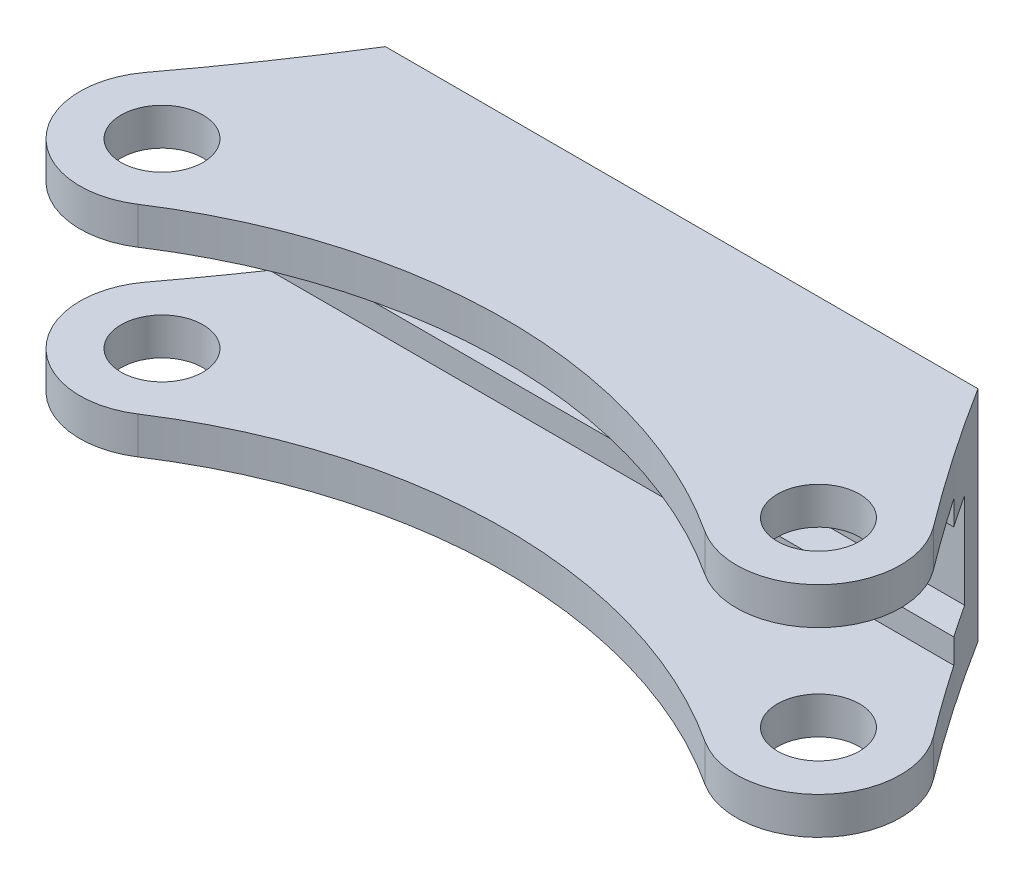
ISO-10303-21;
HEADER;
FILE_DESCRIPTION(('STEP AP214'),'2;1');
FILE_NAME('part.step','',(''),(''),'','','');
FILE_SCHEMA(('AUTOMOTIVE_DESIGN { 1 0 10303 214 1 1 1 1 }'));
ENDSEC;
DATA;
#1=APPLICATION_CONTEXT('core data for automotive mechanical design processes');
#2=APPLICATION_PROTOCOL_DEFINITION('international standard','automotive_design',2000,#1);
#3=PRODUCT_CONTEXT('',#1,'mechanical');
#4=PRODUCT('Part','Part','',(#3));
#5=PRODUCT_RELATED_PRODUCT_CATEGORY('part','',(#4));
#6=PRODUCT_DEFINITION_FORMATION('','',#4);
#7=PRODUCT_DEFINITION_CONTEXT('part definition',#1,'design');
#8=PRODUCT_DEFINITION('design','',#6,#7);
#9=PRODUCT_DEFINITION_SHAPE('','',#8);
#10=(LENGTH_UNIT() NAMED_UNIT(*) SI_UNIT(.MILLI.,.METRE.));
#11=(NAMED_UNIT(*) PLANE_ANGLE_UNIT() SI_UNIT($,.RADIAN.));
#12=(NAMED_UNIT(*) SI_UNIT($,.STERADIAN.) SOLID_ANGLE_UNIT());
#13=UNCERTAINTY_MEASURE_WITH_UNIT(LENGTH_MEASURE(1.E-05),#10,'distance_accuracy_value','');
#14=(GEOMETRIC_REPRESENTATION_CONTEXT(3) GLOBAL_UNCERTAINTY_ASSIGNED_CONTEXT((#13)) GLOBAL_UNIT_ASSIGNED_CONTEXT((#10,
#11,#12)) REPRESENTATION_CONTEXT('',''));
#15=CARTESIAN_POINT('',(0.,0.,0.));
#16=DIRECTION('',(0.,0.,1.));
#17=DIRECTION('',(1.,0.,0.));
#18=AXIS2_PLACEMENT_3D('',#15,#16,#17);
#19=CARTESIAN_POINT('',(47.625,-8.382,4.318));
#20=DIRECTION('',(0.,0.,-1.));
#21=DIRECTION('',(1.,0.,0.));
#22=AXIS2_PLACEMENT_3D('',#19,#20,#21);
#23=PLANE('',#22);
#24=CARTESIAN_POINT('',(19.05,0.,4.318));
#25=DIRECTION('',(0.,0.,-1.));
#26=DIRECTION('',(1.,0.,0.));
#27=AXIS2_PLACEMENT_3D('',#24,#25,#26);
#28=CIRCLE('',#27,3.175);
#29=CARTESIAN_POINT('',(22.225,0.,4.318));
#30=VERTEX_POINT('',#29);
#31=EDGE_CURVE('E272',#30,#30,#28,.T.);
#32=ORIENTED_EDGE('',*,*,#31,.T.);
#33=EDGE_LOOP('',(#32));
#34=FACE_BOUND('',#33,.T.);
#35=CARTESIAN_POINT('',(-19.05,0.,4.318));
#36=DIRECTION('',(0.,0.,-1.));
#37=DIRECTION('',(-1.,0.,0.));
#38=AXIS2_PLACEMENT_3D('',#35,#36,#37);
#39=CIRCLE('',#38,3.175);
#40=CARTESIAN_POINT('',(-22.225,0.,4.318));
#41=VERTEX_POINT('',#40);
#42=EDGE_CURVE('E276',#41,#41,#39,.T.);
#43=ORIENTED_EDGE('',*,*,#42,.T.);
#44=EDGE_LOOP('',(#43));
#45=FACE_BOUND('',#44,.T.);
#46=DIRECTION('',(-1.,0.,0.));
#47=VECTOR('',#46,1.);
#48=CARTESIAN_POINT('',(52.3875,5.5245,4.318));
#49=LINE('',#48,#47);
#50=CARTESIAN_POINT('',(37.1595016436992,5.5245,4.31799999999999));
#51=VERTEX_POINT('',#50);
#52=CARTESIAN_POINT('',(-37.1595016436991,5.5245,4.31799999999999));
#53=VERTEX_POINT('',#52);
#54=EDGE_CURVE('E263',#51,#53,#49,.T.);
#55=ORIENTED_EDGE('',*,*,#54,.T.);
#56=DIRECTION('',(0.,1.,0.));
#57=VECTOR('',#56,1.);
#58=CARTESIAN_POINT('',(-37.1595016436991,-12.7,4.31799999999999));
#59=LINE('',#58,#57);
#60=CARTESIAN_POINT('',(-37.1595016436992,-5.5245,4.31799999999993));
#61=VERTEX_POINT('',#60);
#62=EDGE_CURVE('E247',#61,#53,#59,.T.);
#63=ORIENTED_EDGE('',*,*,#62,.F.);
#64=DIRECTION('',(-1.,0.,0.));
#65=VECTOR('',#64,1.);
#66=CARTESIAN_POINT('',(52.3875,-5.5245,4.318));
#67=LINE('',#66,#65);
#68=CARTESIAN_POINT('',(37.1595016436992,-5.5245,4.31799999999993));
#69=VERTEX_POINT('',#68);
#70=EDGE_CURVE('E261',#69,#61,#67,.T.);
#71=ORIENTED_EDGE('',*,*,#70,.F.);
#72=DIRECTION('',(0.,1.,0.));
#73=VECTOR('',#72,1.);
#74=CARTESIAN_POINT('',(37.1595016436992,-12.7,4.31799999999999));
#75=LINE('',#74,#73);
#76=EDGE_CURVE('E223',#51,#69,#75,.F.);
#77=ORIENTED_EDGE('',*,*,#76,.F.);
#78=EDGE_LOOP('',(#55,#63,#71,#77));
#79=FACE_BOUND('',#78,.T.);
#80=ADVANCED_FACE('F34',(#34,#45,#79),#23,.F.);
#81=CARTESIAN_POINT('',(47.625,-8.382,4.318));
#82=DIRECTION('',(0.,-1.,0.));
#83=DIRECTION('',(0.,0.,1.));
#84=AXIS2_PLACEMENT_3D('',#81,#82,#83);
#85=PLANE('',#84);
#86=CARTESIAN_POINT('',(38.1,-8.382,22.225));
#87=DIRECTION('',(0.,1.,0.));
#88=DIRECTION('',(0.,0.,1.));
#89=AXIS2_PLACEMENT_3D('',#86,#87,#88);
#90=CIRCLE('',#89,4.7625);
#91=CARTESIAN_POINT('',(38.1,-8.382,26.9875));
#92=VERTEX_POINT('',#91);
#93=EDGE_CURVE('E300',#92,#92,#90,.T.);
#94=ORIENTED_EDGE('',*,*,#93,.F.);
#95=EDGE_LOOP('',(#94));
#96=FACE_BOUND('',#95,.T.);
#97=CARTESIAN_POINT('',(-38.1,-8.382,22.225));
#98=DIRECTION('',(0.,1.,0.));
#99=DIRECTION('',(0.,0.,1.));
#100=AXIS2_PLACEMENT_3D('',#97,#98,#99);
#101=CIRCLE('',#100,4.7625);
#102=CARTESIAN_POINT('',(-38.1,-8.382,26.9875));
#103=VERTEX_POINT('',#102);
#104=EDGE_CURVE('E290',#103,#103,#101,.T.);
#105=ORIENTED_EDGE('',*,*,#104,.F.);
#106=EDGE_LOOP('',(#105));
#107=FACE_BOUND('',#106,.T.);
#108=CARTESIAN_POINT('',(0.,-8.382,80.7691073038098));
#109=DIRECTION('',(0.,1.,0.));
#110=DIRECTION('',(0.,0.,1.));
#111=AXIS2_PLACEMENT_3D('',#108,#109,#110);
#112=CIRCLE('',#111,60.325);
#113=CARTESIAN_POINT('',(32.9045454545455,-8.382,30.2082873596104));
#114=VERTEX_POINT('',#113);
#115=CARTESIAN_POINT('',(-32.9045454545455,-8.382,30.2082873596104));
#116=VERTEX_POINT('',#115);
#117=EDGE_CURVE('E204',#114,#116,#112,.T.);
#118=ORIENTED_EDGE('',*,*,#117,.F.);
#119=CARTESIAN_POINT('',(38.1,-8.382,22.225));
#120=DIRECTION('',(0.,1.,0.));
#121=DIRECTION('',(0.,0.,1.));
#122=AXIS2_PLACEMENT_3D('',#119,#120,#121);
#123=CIRCLE('',#122,9.525);
#124=CARTESIAN_POINT('',(45.72,-8.382,16.51));
#125=VERTEX_POINT('',#124);
#126=EDGE_CURVE('E152',#125,#114,#123,.F.);
#127=ORIENTED_EDGE('',*,*,#126,.F.);
#128=CARTESIAN_POINT('',(235.88826987955,-8.382,-126.11620240966));
#129=DIRECTION('',(0.,1.,0.));
#130=DIRECTION('',(0.,0.,1.));
#131=AXIS2_PLACEMENT_3D('',#128,#129,#130);
#132=CIRCLE('',#131,237.710337349436);
#133=CARTESIAN_POINT('',(39.7130966231543,-8.382,8.128));
#134=VERTEX_POINT('',#133);
#135=EDGE_CURVE('E220',#134,#125,#132,.T.);
#136=ORIENTED_EDGE('',*,*,#135,.F.);
#137=DIRECTION('',(-1.,0.,0.));
#138=VECTOR('',#137,1.);
#139=CARTESIAN_POINT('',(52.3875,-8.382,8.128));
#140=LINE('',#139,#138);
#141=CARTESIAN_POINT('',(-39.7130966231542,-8.382,8.128));
#142=VERTEX_POINT('',#141);
#143=EDGE_CURVE('E255',#134,#142,#140,.T.);
#144=ORIENTED_EDGE('',*,*,#143,.T.);
#145=CARTESIAN_POINT('',(-235.88826987955,-8.382,-126.11620240966));
#146=DIRECTION('',(0.,1.,0.));
#147=DIRECTION('',(0.,0.,1.));
#148=AXIS2_PLACEMENT_3D('',#145,#146,#147);
#149=CIRCLE('',#148,237.710337349436);
#150=CARTESIAN_POINT('',(-45.72,-8.382,16.51));
#151=VERTEX_POINT('',#150);
#152=EDGE_CURVE('E244',#151,#142,#149,.T.);
#153=ORIENTED_EDGE('',*,*,#152,.F.);
#154=CARTESIAN_POINT('',(-38.1,-8.382,22.225));
#155=DIRECTION('',(0.,1.,0.));
#156=DIRECTION('',(0.,0.,1.));
#157=AXIS2_PLACEMENT_3D('',#154,#155,#156);
#158=CIRCLE('',#157,9.525);
#159=EDGE_CURVE('E310',#116,#151,#158,.F.);
#160=ORIENTED_EDGE('',*,*,#159,.F.);
#161=EDGE_LOOP('',(#118,#127,#136,#144,#153,#160));
#162=FACE_BOUND('',#161,.T.);
#163=ADVANCED_FACE('F321',(#96,#107,#162),#85,.F.);
#164=CARTESIAN_POINT('',(47.625,8.382,4.318));
#165=DIRECTION('',(0.,1.,0.));
#166=DIRECTION('',(0.,0.,-1.));
#167=AXIS2_PLACEMENT_3D('',#164,#165,#166);
#168=PLANE('',#167);
#169=CARTESIAN_POINT('',(38.1,8.382,22.225));
#170=DIRECTION('',(0.,-1.,0.));
#171=DIRECTION('',(0.,0.,-1.));
#172=AXIS2_PLACEMENT_3D('',#169,#170,#171);
#173=CIRCLE('',#172,4.7625);
#174=CARTESIAN_POINT('',(38.1,8.382,17.4625));
#175=VERTEX_POINT('',#174);
#176=EDGE_CURVE('E301',#175,#175,#173,.T.);
#177=ORIENTED_EDGE('',*,*,#176,.F.);
#178=EDGE_LOOP('',(#177));
#179=FACE_BOUND('',#178,.T.);
#180=CARTESIAN_POINT('',(-38.1,8.382,22.225));
#181=DIRECTION('',(0.,-1.,0.));
#182=DIRECTION('',(0.,0.,-1.));
#183=AXIS2_PLACEMENT_3D('',#180,#181,#182);
#184=CIRCLE('',#183,4.7625);
#185=CARTESIAN_POINT('',(-38.1,8.382,17.4625));
#186=VERTEX_POINT('',#185);
#187=EDGE_CURVE('E291',#186,#186,#184,.T.);
#188=ORIENTED_EDGE('',*,*,#187,.F.);
#189=EDGE_LOOP('',(#188));
#190=FACE_BOUND('',#189,.T.);
#191=CARTESIAN_POINT('',(-38.1,8.382,22.225));
#192=DIRECTION('',(0.,-1.,0.));
#193=DIRECTION('',(0.,0.,-1.));
#194=AXIS2_PLACEMENT_3D('',#191,#192,#193);
#195=CIRCLE('',#194,9.525);
#196=CARTESIAN_POINT('',(-45.72,8.382,16.51));
#197=VERTEX_POINT('',#196);
#198=CARTESIAN_POINT('',(-32.9045454545455,8.382,30.2082873596104));
#199=VERTEX_POINT('',#198);
#200=EDGE_CURVE('E185',#197,#199,#195,.F.);
#201=ORIENTED_EDGE('',*,*,#200,.F.);
#202=CARTESIAN_POINT('',(-235.88826987955,8.382,-126.11620240966));
#203=DIRECTION('',(0.,-1.,0.));
#204=DIRECTION('',(0.,0.,-1.));
#205=AXIS2_PLACEMENT_3D('',#202,#203,#204);
#206=CIRCLE('',#205,237.710337349436);
#207=CARTESIAN_POINT('',(-39.7130966231542,8.382,8.128));
#208=VERTEX_POINT('',#207);
#209=EDGE_CURVE('E198',#208,#197,#206,.T.);
#210=ORIENTED_EDGE('',*,*,#209,.F.);
#211=DIRECTION('',(-1.,0.,0.));
#212=VECTOR('',#211,1.);
#213=CARTESIAN_POINT('',(52.3875,8.382,8.128));
#214=LINE('',#213,#212);
#215=CARTESIAN_POINT('',(39.7130966231543,8.382,8.128));
#216=VERTEX_POINT('',#215);
#217=EDGE_CURVE('E269',#216,#208,#214,.T.);
#218=ORIENTED_EDGE('',*,*,#217,.F.);
#219=CARTESIAN_POINT('',(235.88826987955,8.382,-126.11620240966));
#220=DIRECTION('',(0.,-1.,0.));
#221=DIRECTION('',(0.,0.,-1.));
#222=AXIS2_PLACEMENT_3D('',#219,#220,#221);
#223=CIRCLE('',#222,237.710337349436);
#224=CARTESIAN_POINT('',(45.72,8.382,16.51));
#225=VERTEX_POINT('',#224);
#226=EDGE_CURVE('E229',#225,#216,#223,.T.);
#227=ORIENTED_EDGE('',*,*,#226,.F.);
#228=CARTESIAN_POINT('',(38.1,8.382,22.225));
#229=DIRECTION('',(0.,-1.,0.));
#230=DIRECTION('',(0.,0.,-1.));
#231=AXIS2_PLACEMENT_3D('',#228,#229,#230);
#232=CIRCLE('',#231,9.525);
#233=CARTESIAN_POINT('',(32.9045454545455,8.382,30.2082873596104));
#234=VERTEX_POINT('',#233);
#235=EDGE_CURVE('E182',#234,#225,#232,.F.);
#236=ORIENTED_EDGE('',*,*,#235,.F.);
#237=CARTESIAN_POINT('',(0.,8.382,80.7691073038098));
#238=DIRECTION('',(0.,-1.,0.));
#239=DIRECTION('',(0.,0.,-1.));
#240=AXIS2_PLACEMENT_3D('',#237,#238,#239);
#241=CIRCLE('',#240,60.325);
#242=EDGE_CURVE('E201',#199,#234,#241,.T.);
#243=ORIENTED_EDGE('',*,*,#242,.F.);
#244=EDGE_LOOP('',(#201,#210,#218,#227,#236,#243));
#245=FACE_BOUND('',#244,.T.);
#246=ADVANCED_FACE('F196',(#179,#190,#245),#168,.F.);
#247=CARTESIAN_POINT('',(47.625,12.7,31.75));
#248=DIRECTION('',(0.,-1.,0.));
#249=DIRECTION('',(0.,0.,1.));
#250=AXIS2_PLACEMENT_3D('',#247,#248,#249);
#251=PLANE('',#250);
#252=CARTESIAN_POINT('',(-38.1,12.7,22.225));
#253=DIRECTION('',(0.,-1.,0.));
#254=DIRECTION('',(0.,0.,1.));
#255=AXIS2_PLACEMENT_3D('',#252,#253,#254);
#256=CIRCLE('',#255,4.7625);
#257=CARTESIAN_POINT('',(-38.1,12.7,26.9875));
#258=VERTEX_POINT('',#257);
#259=EDGE_CURVE('E282',#258,#258,#256,.T.);
#260=ORIENTED_EDGE('',*,*,#259,.T.);
#261=EDGE_LOOP('',(#260));
#262=FACE_BOUND('',#261,.T.);
#263=CARTESIAN_POINT('',(38.1,12.7,22.225));
#264=DIRECTION('',(0.,-1.,0.));
#265=DIRECTION('',(0.,0.,-1.));
#266=AXIS2_PLACEMENT_3D('',#263,#264,#265);
#267=CIRCLE('',#266,4.7625);
#268=CARTESIAN_POINT('',(38.1,12.7,17.4625));
#269=VERTEX_POINT('',#268);
#270=EDGE_CURVE('E294',#269,#269,#267,.T.);
#271=ORIENTED_EDGE('',*,*,#270,.T.);
#272=EDGE_LOOP('',(#271));
#273=FACE_BOUND('',#272,.T.);
#274=CARTESIAN_POINT('',(0.,12.7,80.7691073038098));
#275=DIRECTION('',(0.,-1.,0.));
#276=DIRECTION('',(0.,0.,-1.));
#277=AXIS2_PLACEMENT_3D('',#274,#275,#276);
#278=CIRCLE('',#277,60.325);
#279=CARTESIAN_POINT('',(-32.9045454545455,12.7,30.2082873596104));
#280=VERTEX_POINT('',#279);
#281=CARTESIAN_POINT('',(32.9045454545455,12.7,30.2082873596104));
#282=VERTEX_POINT('',#281);
#283=EDGE_CURVE('E166',#280,#282,#278,.T.);
#284=ORIENTED_EDGE('',*,*,#283,.T.);
#285=CARTESIAN_POINT('',(38.1,12.7,22.225));
#286=DIRECTION('',(0.,1.,0.));
#287=DIRECTION('',(0.,0.,1.));
#288=AXIS2_PLACEMENT_3D('',#285,#286,#287);
#289=CIRCLE('',#288,9.525);
#290=CARTESIAN_POINT('',(45.72,12.7,16.51));
#291=VERTEX_POINT('',#290);
#292=EDGE_CURVE('E171',#291,#282,#289,.F.);
#293=ORIENTED_EDGE('',*,*,#292,.F.);
#294=CARTESIAN_POINT('',(235.88826987955,12.7,-126.11620240966));
#295=DIRECTION('',(0.,-1.,0.));
#296=DIRECTION('',(0.,0.,1.));
#297=AXIS2_PLACEMENT_3D('',#294,#295,#296);
#298=CIRCLE('',#297,237.710337349436);
#299=CARTESIAN_POINT('',(34.3916,12.7,0.));
#300=VERTEX_POINT('',#299);
#301=EDGE_CURVE('E206',#291,#300,#298,.T.);
#302=ORIENTED_EDGE('',*,*,#301,.T.);
#303=DIRECTION('',(-1.,0.,0.));
#304=VECTOR('',#303,1.);
#305=CARTESIAN_POINT('',(47.625,12.7,0.));
#306=LINE('',#305,#304);
#307=CARTESIAN_POINT('',(-34.3916,12.7,0.));
#308=VERTEX_POINT('',#307);
#309=EDGE_CURVE('E307',#300,#308,#306,.T.);
#310=ORIENTED_EDGE('',*,*,#309,.T.);
#311=CARTESIAN_POINT('',(-235.88826987955,12.7,-126.11620240966));
#312=DIRECTION('',(0.,-1.,0.));
#313=DIRECTION('',(0.,0.,-1.));
#314=AXIS2_PLACEMENT_3D('',#311,#312,#313);
#315=CIRCLE('',#314,237.710337349436);
#316=CARTESIAN_POINT('',(-45.72,12.7,16.51));
#317=VERTEX_POINT('',#316);
#318=EDGE_CURVE('E232',#308,#317,#315,.T.);
#319=ORIENTED_EDGE('',*,*,#318,.T.);
#320=CARTESIAN_POINT('',(-38.1,12.7,22.225));
#321=DIRECTION('',(0.,1.,0.));
#322=DIRECTION('',(0.,0.,1.));
#323=AXIS2_PLACEMENT_3D('',#320,#321,#322);
#324=CIRCLE('',#323,9.525);
#325=EDGE_CURVE('E175',#280,#317,#324,.F.);
#326=ORIENTED_EDGE('',*,*,#325,.F.);
#327=EDGE_LOOP('',(#284,#293,#302,#310,#319,#326));
#328=FACE_BOUND('',#327,.T.);
#329=ADVANCED_FACE('F356',(#262,#273,#328),#251,.F.);
#330=CARTESIAN_POINT('',(47.625,12.7,0.));
#331=DIRECTION('',(0.,0.,1.));
#332=DIRECTION('',(-1.,0.,0.));
#333=AXIS2_PLACEMENT_3D('',#330,#331,#332);
#334=PLANE('',#333);
#335=CARTESIAN_POINT('',(19.05,0.,0.));
#336=DIRECTION('',(0.,0.,-1.));
#337=DIRECTION('',(1.,0.,0.));
#338=AXIS2_PLACEMENT_3D('',#335,#336,#337);
#339=CIRCLE('',#338,3.175);
#340=CARTESIAN_POINT('',(22.225,0.,0.));
#341=VERTEX_POINT('',#340);
#342=EDGE_CURVE('E273',#341,#341,#339,.T.);
#343=ORIENTED_EDGE('',*,*,#342,.F.);
#344=EDGE_LOOP('',(#343));
#345=FACE_BOUND('',#344,.T.);
#346=CARTESIAN_POINT('',(-19.05,0.,0.));
#347=DIRECTION('',(0.,0.,-1.));
#348=DIRECTION('',(-1.,0.,0.));
#349=AXIS2_PLACEMENT_3D('',#346,#347,#348);
#350=CIRCLE('',#349,3.175);
#351=CARTESIAN_POINT('',(-22.225,0.,0.));
#352=VERTEX_POINT('',#351);
#353=EDGE_CURVE('E279',#352,#352,#350,.T.);
#354=ORIENTED_EDGE('',*,*,#353,.F.);
#355=EDGE_LOOP('',(#354));
#356=FACE_BOUND('',#355,.T.);
#357=DIRECTION('',(-1.,0.,0.));
#358=VECTOR('',#357,1.);
#359=CARTESIAN_POINT('',(47.625,-12.7,0.));
#360=LINE('',#359,#358);
#361=CARTESIAN_POINT('',(34.3916,-12.7,0.));
#362=VERTEX_POINT('',#361);
#363=CARTESIAN_POINT('',(-34.3916,-12.7,0.));
#364=VERTEX_POINT('',#363);
#365=EDGE_CURVE('E304',#362,#364,#360,.T.);
#366=ORIENTED_EDGE('',*,*,#365,.T.);
#367=DIRECTION('',(0.,1.,0.));
#368=VECTOR('',#367,1.);
#369=CARTESIAN_POINT('',(-34.3916,-12.7,0.));
#370=LINE('',#369,#368);
#371=EDGE_CURVE('E238',#364,#308,#370,.T.);
#372=ORIENTED_EDGE('',*,*,#371,.T.);
#373=ORIENTED_EDGE('',*,*,#309,.F.);
#374=DIRECTION('',(0.,1.,0.));
#375=VECTOR('',#374,1.);
#376=CARTESIAN_POINT('',(34.3916,-12.7,0.));
#377=LINE('',#376,#375);
#378=EDGE_CURVE('E214',#362,#300,#377,.T.);
#379=ORIENTED_EDGE('',*,*,#378,.F.);
#380=EDGE_LOOP('',(#366,#372,#373,#379));
#381=FACE_BOUND('',#380,.T.);
#382=ADVANCED_FACE('F329',(#345,#356,#381),#334,.F.);
#383=CARTESIAN_POINT('',(47.625,-12.7,31.75));
#384=DIRECTION('',(0.,1.,0.));
#385=DIRECTION('',(0.,0.,-1.));
#386=AXIS2_PLACEMENT_3D('',#383,#384,#385);
#387=PLANE('',#386);
#388=CARTESIAN_POINT('',(-38.1,-12.7,22.225));
#389=DIRECTION('',(0.,-1.,0.));
#390=DIRECTION('',(0.,0.,1.));
#391=AXIS2_PLACEMENT_3D('',#388,#389,#390);
#392=CIRCLE('',#391,4.7625);
#393=CARTESIAN_POINT('',(-38.1,-12.7,26.9875));
#394=VERTEX_POINT('',#393);
#395=EDGE_CURVE('E287',#394,#394,#392,.T.);
#396=ORIENTED_EDGE('',*,*,#395,.F.);
#397=EDGE_LOOP('',(#396));
#398=FACE_BOUND('',#397,.T.);
#399=CARTESIAN_POINT('',(38.1,-12.7,22.225));
#400=DIRECTION('',(0.,-1.,0.));
#401=DIRECTION('',(0.,0.,-1.));
#402=AXIS2_PLACEMENT_3D('',#399,#400,#401);
#403=CIRCLE('',#402,4.7625);
#404=CARTESIAN_POINT('',(38.1,-12.7,17.4625));
#405=VERTEX_POINT('',#404);
#406=EDGE_CURVE('E297',#405,#405,#403,.T.);
#407=ORIENTED_EDGE('',*,*,#406,.F.);
#408=EDGE_LOOP('',(#407));
#409=FACE_BOUND('',#408,.T.);
#410=CARTESIAN_POINT('',(-38.1,-12.7,22.225));
#411=DIRECTION('',(0.,-1.,0.));
#412=DIRECTION('',(0.,0.,-1.));
#413=AXIS2_PLACEMENT_3D('',#410,#411,#412);
#414=CIRCLE('',#413,9.525);
#415=CARTESIAN_POINT('',(-45.72,-12.7,16.51));
#416=VERTEX_POINT('',#415);
#417=CARTESIAN_POINT('',(-32.9045454545455,-12.7,30.2082873596104));
#418=VERTEX_POINT('',#417);
#419=EDGE_CURVE('E172',#416,#418,#414,.F.);
#420=ORIENTED_EDGE('',*,*,#419,.F.);
#421=CARTESIAN_POINT('',(-235.88826987955,-12.7,-126.11620240966));
#422=DIRECTION('',(0.,-1.,0.));
#423=DIRECTION('',(0.,0.,-1.));
#424=AXIS2_PLACEMENT_3D('',#421,#422,#423);
#425=CIRCLE('',#424,237.710337349436);
#426=EDGE_CURVE('E233',#364,#416,#425,.T.);
#427=ORIENTED_EDGE('',*,*,#426,.F.);
#428=ORIENTED_EDGE('',*,*,#365,.F.);
#429=CARTESIAN_POINT('',(235.88826987955,-12.7,-126.11620240966));
#430=DIRECTION('',(0.,-1.,0.));
#431=DIRECTION('',(0.,0.,1.));
#432=AXIS2_PLACEMENT_3D('',#429,#430,#431);
#433=CIRCLE('',#432,237.710337349436);
#434=CARTESIAN_POINT('',(45.72,-12.7,16.51));
#435=VERTEX_POINT('',#434);
#436=EDGE_CURVE('E170',#435,#362,#433,.T.);
#437=ORIENTED_EDGE('',*,*,#436,.F.);
#438=CARTESIAN_POINT('',(38.1,-12.7,22.225));
#439=DIRECTION('',(0.,-1.,0.));
#440=DIRECTION('',(0.,0.,-1.));
#441=AXIS2_PLACEMENT_3D('',#438,#439,#440);
#442=CIRCLE('',#441,9.525);
#443=CARTESIAN_POINT('',(32.9045454545455,-12.7,30.2082873596104));
#444=VERTEX_POINT('',#443);
#445=EDGE_CURVE('E149',#444,#435,#442,.F.);
#446=ORIENTED_EDGE('',*,*,#445,.F.);
#447=CARTESIAN_POINT('',(0.,-12.7,80.7691073038098));
#448=DIRECTION('',(0.,-1.,0.));
#449=DIRECTION('',(0.,0.,-1.));
#450=AXIS2_PLACEMENT_3D('',#447,#448,#449);
#451=CIRCLE('',#450,60.325);
#452=EDGE_CURVE('E160',#418,#444,#451,.T.);
#453=ORIENTED_EDGE('',*,*,#452,.F.);
#454=EDGE_LOOP('',(#420,#427,#428,#437,#446,#453));
#455=FACE_BOUND('',#454,.T.);
#456=ADVANCED_FACE('F168',(#398,#409,#455),#387,.F.);
#457=CARTESIAN_POINT('',(38.1,-12.7,22.225));
#458=DIRECTION('',(0.,1.,0.));
#459=DIRECTION('',(0.,0.,-1.));
#460=AXIS2_PLACEMENT_3D('',#457,#458,#459);
#461=CYLINDRICAL_SURFACE('',#460,4.7625);
#462=ORIENTED_EDGE('',*,*,#406,.T.);
#463=EDGE_LOOP('',(#462));
#464=FACE_BOUND('',#463,.T.);
#465=ORIENTED_EDGE('',*,*,#93,.T.);
#466=EDGE_LOOP('',(#465));
#467=FACE_BOUND('',#466,.T.);
#468=ADVANCED_FACE('F383',(#464,#467),#461,.F.);
#469=ORIENTED_EDGE('',*,*,#270,.F.);
#470=EDGE_LOOP('',(#469));
#471=FACE_BOUND('',#470,.T.);
#472=ORIENTED_EDGE('',*,*,#176,.T.);
#473=EDGE_LOOP('',(#472));
#474=FACE_BOUND('',#473,.T.);
#475=ADVANCED_FACE('F379',(#471,#474),#461,.F.);
#476=CARTESIAN_POINT('',(-38.1,-12.7,22.225));
#477=DIRECTION('',(0.,1.,0.));
#478=DIRECTION('',(0.,0.,-1.));
#479=AXIS2_PLACEMENT_3D('',#476,#477,#478);
#480=CYLINDRICAL_SURFACE('',#479,4.7625);
#481=ORIENTED_EDGE('',*,*,#395,.T.);
#482=EDGE_LOOP('',(#481));
#483=FACE_BOUND('',#482,.T.);
#484=ORIENTED_EDGE('',*,*,#104,.T.);
#485=EDGE_LOOP('',(#484));
#486=FACE_BOUND('',#485,.T.);
#487=ADVANCED_FACE('F397',(#483,#486),#480,.F.);
#488=ORIENTED_EDGE('',*,*,#259,.F.);
#489=EDGE_LOOP('',(#488));
#490=FACE_BOUND('',#489,.T.);
#491=ORIENTED_EDGE('',*,*,#187,.T.);
#492=EDGE_LOOP('',(#491));
#493=FACE_BOUND('',#492,.T.);
#494=ADVANCED_FACE('F399',(#490,#493),#480,.F.);
#495=CARTESIAN_POINT('',(38.1,8.382,22.225));
#496=DIRECTION('',(0.,-1.,0.));
#497=DIRECTION('',(0.,0.,1.));
#498=AXIS2_PLACEMENT_3D('',#495,#496,#497);
#499=CYLINDRICAL_SURFACE('',#498,9.525);
#500=ORIENTED_EDGE('',*,*,#445,.T.);
#501=DIRECTION('',(0.,1.,0.));
#502=VECTOR('',#501,1.);
#503=CARTESIAN_POINT('',(45.72,-12.7,16.51));
#504=LINE('',#503,#502);
#505=EDGE_CURVE('E217',#435,#125,#504,.T.);
#506=ORIENTED_EDGE('',*,*,#505,.T.);
#507=ORIENTED_EDGE('',*,*,#126,.T.);
#508=DIRECTION('',(0.,1.,0.));
#509=VECTOR('',#508,1.);
#510=CARTESIAN_POINT('',(32.9045454545455,-12.7,30.2082873596104));
#511=LINE('',#510,#509);
#512=EDGE_CURVE('E145',#444,#114,#511,.T.);
#513=ORIENTED_EDGE('',*,*,#512,.F.);
#514=EDGE_LOOP('',(#500,#506,#507,#513));
#515=FACE_BOUND('',#514,.T.);
#516=ADVANCED_FACE('F147',(#515),#499,.T.);
#517=CARTESIAN_POINT('',(-38.1,-8.382,22.225));
#518=DIRECTION('',(0.,1.,0.));
#519=DIRECTION('',(0.,0.,-1.));
#520=AXIS2_PLACEMENT_3D('',#517,#518,#519);
#521=CYLINDRICAL_SURFACE('',#520,9.525);
#522=ORIENTED_EDGE('',*,*,#419,.T.);
#523=DIRECTION('',(0.,1.,0.));
#524=VECTOR('',#523,1.);
#525=CARTESIAN_POINT('',(-32.9045454545455,-12.7,30.2082873596104));
#526=LINE('',#525,#524);
#527=EDGE_CURVE('E162',#418,#116,#526,.T.);
#528=ORIENTED_EDGE('',*,*,#527,.T.);
#529=ORIENTED_EDGE('',*,*,#159,.T.);
#530=DIRECTION('',(0.,1.,0.));
#531=VECTOR('',#530,1.);
#532=CARTESIAN_POINT('',(-45.72,-12.7,16.51));
#533=LINE('',#532,#531);
#534=EDGE_CURVE('E241',#416,#151,#533,.T.);
#535=ORIENTED_EDGE('',*,*,#534,.F.);
#536=EDGE_LOOP('',(#522,#528,#529,#535));
#537=FACE_BOUND('',#536,.T.);
#538=ADVANCED_FACE('F319',(#537),#521,.T.);
#539=CARTESIAN_POINT('',(-38.1,8.382,22.225));
#540=DIRECTION('',(0.,1.,0.));
#541=DIRECTION('',(0.,0.,-1.));
#542=AXIS2_PLACEMENT_3D('',#539,#540,#541);
#543=CYLINDRICAL_SURFACE('',#542,9.525);
#544=ORIENTED_EDGE('',*,*,#200,.T.);
#545=EDGE_CURVE('E156',#199,#280,#526,.T.);
#546=ORIENTED_EDGE('',*,*,#545,.T.);
#547=ORIENTED_EDGE('',*,*,#325,.T.);
#548=EDGE_CURVE('E191',#197,#317,#533,.T.);
#549=ORIENTED_EDGE('',*,*,#548,.F.);
#550=EDGE_LOOP('',(#544,#546,#547,#549));
#551=FACE_BOUND('',#550,.T.);
#552=ADVANCED_FACE('F189',(#551),#543,.T.);
#553=CARTESIAN_POINT('',(38.1,8.382,22.225));
#554=DIRECTION('',(0.,-1.,0.));
#555=DIRECTION('',(0.,0.,1.));
#556=AXIS2_PLACEMENT_3D('',#553,#554,#555);
#557=CYLINDRICAL_SURFACE('',#556,9.525);
#558=ORIENTED_EDGE('',*,*,#235,.T.);
#559=EDGE_CURVE('E211',#225,#291,#504,.T.);
#560=ORIENTED_EDGE('',*,*,#559,.T.);
#561=ORIENTED_EDGE('',*,*,#292,.T.);
#562=EDGE_CURVE('E157',#234,#282,#511,.T.);
#563=ORIENTED_EDGE('',*,*,#562,.F.);
#564=EDGE_LOOP('',(#558,#560,#561,#563));
#565=FACE_BOUND('',#564,.T.);
#566=ADVANCED_FACE('F36',(#565),#557,.T.);
#567=CARTESIAN_POINT('',(-19.05,0.,0.));
#568=DIRECTION('',(0.,0.,1.));
#569=DIRECTION('',(-1.,0.,0.));
#570=AXIS2_PLACEMENT_3D('',#567,#568,#569);
#571=CYLINDRICAL_SURFACE('',#570,3.175);
#572=ORIENTED_EDGE('',*,*,#353,.T.);
#573=EDGE_LOOP('',(#572));
#574=FACE_BOUND('',#573,.T.);
#575=ORIENTED_EDGE('',*,*,#42,.F.);
#576=EDGE_LOOP('',(#575));
#577=FACE_BOUND('',#576,.T.);
#578=ADVANCED_FACE('F408',(#574,#577),#571,.F.);
#579=CARTESIAN_POINT('',(19.05,0.,0.));
#580=DIRECTION('',(0.,0.,1.));
#581=DIRECTION('',(-1.,0.,0.));
#582=AXIS2_PLACEMENT_3D('',#579,#580,#581);
#583=CYLINDRICAL_SURFACE('',#582,3.175);
#584=ORIENTED_EDGE('',*,*,#342,.T.);
#585=EDGE_LOOP('',(#584));
#586=FACE_BOUND('',#585,.T.);
#587=ORIENTED_EDGE('',*,*,#31,.F.);
#588=EDGE_LOOP('',(#587));
#589=FACE_BOUND('',#588,.T.);
#590=ADVANCED_FACE('F411',(#586,#589),#583,.F.);
#591=CARTESIAN_POINT('',(52.3875,5.5245,4.318));
#592=DIRECTION('',(0.,1.,0.));
#593=DIRECTION('',(0.,0.,-1.));
#594=AXIS2_PLACEMENT_3D('',#591,#592,#593);
#595=PLANE('',#594);
#596=DIRECTION('',(-1.,0.,0.));
#597=VECTOR('',#596,1.);
#598=CARTESIAN_POINT('',(52.3875,5.5245,8.128));
#599=LINE('',#598,#597);
#600=CARTESIAN_POINT('',(39.7130966231543,5.5245,8.12799999999994));
#601=VERTEX_POINT('',#600);
#602=CARTESIAN_POINT('',(-39.7130966231542,5.5245,8.12799999999994));
#603=VERTEX_POINT('',#602);
#604=EDGE_CURVE('E266',#601,#603,#599,.T.);
#605=ORIENTED_EDGE('',*,*,#604,.T.);
#606=CARTESIAN_POINT('',(-235.88826987955,5.5245,-126.11620240966));
#607=DIRECTION('',(0.,-1.,0.));
#608=DIRECTION('',(0.,0.,-1.));
#609=AXIS2_PLACEMENT_3D('',#606,#607,#608);
#610=CIRCLE('',#609,237.710337349436);
#611=EDGE_CURVE('E249',#53,#603,#610,.T.);
#612=ORIENTED_EDGE('',*,*,#611,.F.);
#613=ORIENTED_EDGE('',*,*,#54,.F.);
#614=CARTESIAN_POINT('',(235.88826987955,5.5245,-126.11620240966));
#615=DIRECTION('',(0.,-1.,0.));
#616=DIRECTION('',(0.,0.,-1.));
#617=AXIS2_PLACEMENT_3D('',#614,#615,#616);
#618=CIRCLE('',#617,237.710337349436);
#619=EDGE_CURVE('E225',#601,#51,#618,.T.);
#620=ORIENTED_EDGE('',*,*,#619,.F.);
#621=EDGE_LOOP('',(#605,#612,#613,#620));
#622=FACE_BOUND('',#621,.T.);
#623=ADVANCED_FACE('F347',(#622),#595,.F.);
#624=CARTESIAN_POINT('',(52.3875,8.382,8.128));
#625=DIRECTION('',(0.,0.,-1.));
#626=DIRECTION('',(1.,0.,0.));
#627=AXIS2_PLACEMENT_3D('',#624,#625,#626);
#628=PLANE('',#627);
#629=ORIENTED_EDGE('',*,*,#217,.T.);
#630=DIRECTION('',(0.,1.,0.));
#631=VECTOR('',#630,1.);
#632=CARTESIAN_POINT('',(-39.7130966231542,-12.7,8.128));
#633=LINE('',#632,#631);
#634=EDGE_CURVE('E252',#603,#208,#633,.T.);
#635=ORIENTED_EDGE('',*,*,#634,.F.);
#636=ORIENTED_EDGE('',*,*,#604,.F.);
#637=DIRECTION('',(0.,1.,0.));
#638=VECTOR('',#637,1.);
#639=CARTESIAN_POINT('',(39.7130966231543,-12.7,8.128));
#640=LINE('',#639,#638);
#641=EDGE_CURVE('E227',#216,#601,#640,.F.);
#642=ORIENTED_EDGE('',*,*,#641,.F.);
#643=EDGE_LOOP('',(#629,#635,#636,#642));
#644=FACE_BOUND('',#643,.T.);
#645=ADVANCED_FACE('F349',(#644),#628,.F.);
#646=CARTESIAN_POINT('',(52.3875,-8.382,8.128));
#647=DIRECTION('',(0.,0.,-1.));
#648=DIRECTION('',(1.,0.,0.));
#649=AXIS2_PLACEMENT_3D('',#646,#647,#648);
#650=PLANE('',#649);
#651=DIRECTION('',(-1.,0.,0.));
#652=VECTOR('',#651,1.);
#653=CARTESIAN_POINT('',(52.3875,-5.5245,8.128));
#654=LINE('',#653,#652);
#655=CARTESIAN_POINT('',(39.7130966231543,-5.5245,8.12799999999994));
#656=VERTEX_POINT('',#655);
#657=CARTESIAN_POINT('',(-39.7130966231542,-5.5245,8.12799999999994));
#658=VERTEX_POINT('',#657);
#659=EDGE_CURVE('E258',#656,#658,#654,.T.);
#660=ORIENTED_EDGE('',*,*,#659,.T.);
#661=DIRECTION('',(0.,1.,0.));
#662=VECTOR('',#661,1.);
#663=CARTESIAN_POINT('',(-39.7130966231542,-12.7,8.128));
#664=LINE('',#663,#662);
#665=EDGE_CURVE('E240',#142,#658,#664,.T.);
#666=ORIENTED_EDGE('',*,*,#665,.F.);
#667=ORIENTED_EDGE('',*,*,#143,.F.);
#668=DIRECTION('',(0.,1.,0.));
#669=VECTOR('',#668,1.);
#670=CARTESIAN_POINT('',(39.7130966231543,-12.7,8.128));
#671=LINE('',#670,#669);
#672=EDGE_CURVE('E216',#656,#134,#671,.F.);
#673=ORIENTED_EDGE('',*,*,#672,.F.);
#674=EDGE_LOOP('',(#660,#666,#667,#673));
#675=FACE_BOUND('',#674,.T.);
#676=ADVANCED_FACE('F336',(#675),#650,.F.);
#677=CARTESIAN_POINT('',(52.3875,-5.5245,4.318));
#678=DIRECTION('',(0.,-1.,0.));
#679=DIRECTION('',(0.,0.,1.));
#680=AXIS2_PLACEMENT_3D('',#677,#678,#679);
#681=PLANE('',#680);
#682=ORIENTED_EDGE('',*,*,#70,.T.);
#683=CARTESIAN_POINT('',(-235.88826987955,-5.5245,-126.11620240966));
#684=DIRECTION('',(0.,1.,0.));
#685=DIRECTION('',(0.,0.,1.));
#686=AXIS2_PLACEMENT_3D('',#683,#684,#685);
#687=CIRCLE('',#686,237.710337349436);
#688=EDGE_CURVE('E42',#658,#61,#687,.T.);
#689=ORIENTED_EDGE('',*,*,#688,.F.);
#690=ORIENTED_EDGE('',*,*,#659,.F.);
#691=CARTESIAN_POINT('',(235.88826987955,-5.5245,-126.11620240966));
#692=DIRECTION('',(0.,1.,0.));
#693=DIRECTION('',(0.,0.,1.));
#694=AXIS2_PLACEMENT_3D('',#691,#692,#693);
#695=CIRCLE('',#694,237.710337349436);
#696=EDGE_CURVE('E11',#69,#656,#695,.T.);
#697=ORIENTED_EDGE('',*,*,#696,.F.);
#698=EDGE_LOOP('',(#682,#689,#690,#697));
#699=FACE_BOUND('',#698,.T.);
#700=ADVANCED_FACE('F338',(#699),#681,.F.);
#701=CARTESIAN_POINT('',(-235.88826987955,-12.7,-126.11620240966));
#702=DIRECTION('',(0.,1.,0.));
#703=DIRECTION('',(0.,0.,-1.));
#704=AXIS2_PLACEMENT_3D('',#701,#702,#703);
#705=CYLINDRICAL_SURFACE('',#704,237.710337349436);
#706=ORIENTED_EDGE('',*,*,#634,.T.);
#707=ORIENTED_EDGE('',*,*,#209,.T.);
#708=ORIENTED_EDGE('',*,*,#548,.T.);
#709=ORIENTED_EDGE('',*,*,#318,.F.);
#710=ORIENTED_EDGE('',*,*,#371,.F.);
#711=ORIENTED_EDGE('',*,*,#426,.T.);
#712=ORIENTED_EDGE('',*,*,#534,.T.);
#713=ORIENTED_EDGE('',*,*,#152,.T.);
#714=ORIENTED_EDGE('',*,*,#665,.T.);
#715=ORIENTED_EDGE('',*,*,#688,.T.);
#716=ORIENTED_EDGE('',*,*,#62,.T.);
#717=ORIENTED_EDGE('',*,*,#611,.T.);
#718=EDGE_LOOP('',(#706,#707,#708,#709,#710,#711,#712,#713,#714,#715,#716,#717));
#719=FACE_BOUND('',#718,.T.);
#720=ADVANCED_FACE('F324',(#719),#705,.F.);
#721=CARTESIAN_POINT('',(235.88826987955,-12.7,-126.11620240966));
#722=DIRECTION('',(0.,1.,0.));
#723=DIRECTION('',(0.,0.,-1.));
#724=AXIS2_PLACEMENT_3D('',#721,#722,#723);
#725=CYLINDRICAL_SURFACE('',#724,237.710337349436);
#726=ORIENTED_EDGE('',*,*,#559,.F.);
#727=ORIENTED_EDGE('',*,*,#226,.T.);
#728=ORIENTED_EDGE('',*,*,#641,.T.);
#729=ORIENTED_EDGE('',*,*,#619,.T.);
#730=ORIENTED_EDGE('',*,*,#76,.T.);
#731=ORIENTED_EDGE('',*,*,#696,.T.);
#732=ORIENTED_EDGE('',*,*,#672,.T.);
#733=ORIENTED_EDGE('',*,*,#135,.T.);
#734=ORIENTED_EDGE('',*,*,#505,.F.);
#735=ORIENTED_EDGE('',*,*,#436,.T.);
#736=ORIENTED_EDGE('',*,*,#378,.T.);
#737=ORIENTED_EDGE('',*,*,#301,.F.);
#738=EDGE_LOOP('',(#726,#727,#728,#729,#730,#731,#732,#733,#734,#735,#736,#737));
#739=FACE_BOUND('',#738,.T.);
#740=ADVANCED_FACE('F332',(#739),#725,.F.);
#741=CARTESIAN_POINT('',(0.,-12.7,80.7691073038098));
#742=DIRECTION('',(0.,1.,0.));
#743=DIRECTION('',(0.,0.,-1.));
#744=AXIS2_PLACEMENT_3D('',#741,#742,#743);
#745=CYLINDRICAL_SURFACE('',#744,60.325);
#746=ORIENTED_EDGE('',*,*,#545,.F.);
#747=ORIENTED_EDGE('',*,*,#242,.T.);
#748=ORIENTED_EDGE('',*,*,#562,.T.);
#749=ORIENTED_EDGE('',*,*,#283,.F.);
#750=EDGE_LOOP('',(#746,#747,#748,#749));
#751=FACE_BOUND('',#750,.T.);
#752=ADVANCED_FACE('F353',(#751),#745,.F.);
#753=ORIENTED_EDGE('',*,*,#512,.T.);
#754=ORIENTED_EDGE('',*,*,#117,.T.);
#755=ORIENTED_EDGE('',*,*,#527,.F.);
#756=ORIENTED_EDGE('',*,*,#452,.T.);
#757=EDGE_LOOP('',(#753,#754,#755,#756));
#758=FACE_BOUND('',#757,.T.);
#759=ADVANCED_FACE('F161',(#758),#745,.F.);
#760=CLOSED_SHELL('',(#80,#163,#246,#329,#382,#456,#468,#475,#487,#494,#516,#538,#552,#566,#578,
#590,#623,#645,#676,#700,#720,#740,#752,#759));
#761=MANIFOLD_SOLID_BREP('B2',#760);
#762=ADVANCED_BREP_SHAPE_REPRESENTATION('',(#18,#761),#14);
#763=SHAPE_DEFINITION_REPRESENTATION(#9,#762);
ENDSEC;
END-ISO-10303-21;
